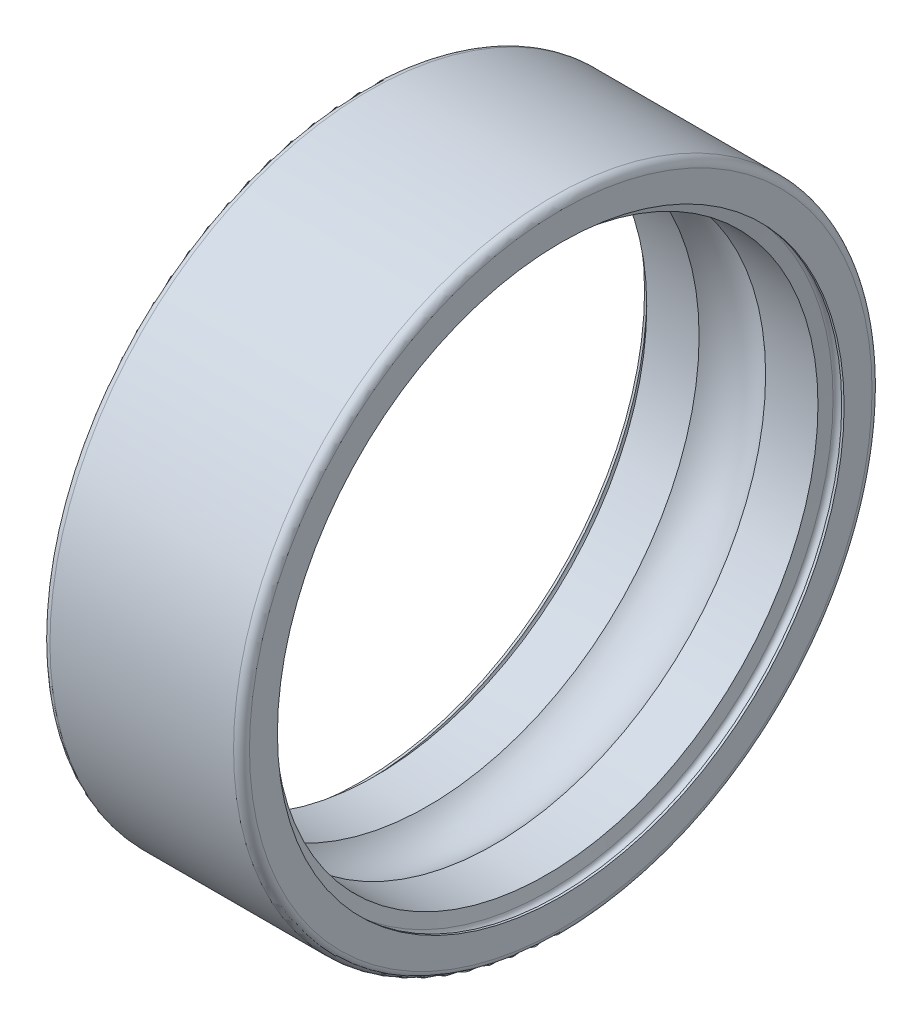
ISO-10303-21;
HEADER;
FILE_DESCRIPTION(('STEP AP214'),'2;1');
FILE_NAME('part.step','',(''),(''),'','','');
FILE_SCHEMA(('AUTOMOTIVE_DESIGN { 1 0 10303 214 1 1 1 1 }'));
ENDSEC;
DATA;
#1=APPLICATION_CONTEXT('core data for automotive mechanical design processes');
#2=APPLICATION_PROTOCOL_DEFINITION('international standard','automotive_design',2000,#1);
#3=PRODUCT_CONTEXT('',#1,'mechanical');
#4=PRODUCT('Part','Part','',(#3));
#5=PRODUCT_RELATED_PRODUCT_CATEGORY('part','',(#4));
#6=PRODUCT_DEFINITION_FORMATION('','',#4);
#7=PRODUCT_DEFINITION_CONTEXT('part definition',#1,'design');
#8=PRODUCT_DEFINITION('design','',#6,#7);
#9=PRODUCT_DEFINITION_SHAPE('','',#8);
#10=(LENGTH_UNIT() NAMED_UNIT(*) SI_UNIT(.MILLI.,.METRE.));
#11=(NAMED_UNIT(*) PLANE_ANGLE_UNIT() SI_UNIT($,.RADIAN.));
#12=(NAMED_UNIT(*) SI_UNIT($,.STERADIAN.) SOLID_ANGLE_UNIT());
#13=UNCERTAINTY_MEASURE_WITH_UNIT(LENGTH_MEASURE(1.E-05),#10,'distance_accuracy_value','');
#14=(GEOMETRIC_REPRESENTATION_CONTEXT(3) GLOBAL_UNCERTAINTY_ASSIGNED_CONTEXT((#13)) GLOBAL_UNIT_ASSIGNED_CONTEXT((#10,
#11,#12)) REPRESENTATION_CONTEXT('',''));
#15=CARTESIAN_POINT('',(0.,0.,0.));
#16=DIRECTION('',(0.,0.,1.));
#17=DIRECTION('',(1.,0.,0.));
#18=AXIS2_PLACEMENT_3D('',#15,#16,#17);
#19=CARTESIAN_POINT('',(4.64525071236117,0.,0.));
#20=DIRECTION('',(1.,0.,0.));
#21=DIRECTION('',(0.,0.,-1.));
#22=AXIS2_PLACEMENT_3D('',#19,#20,#21);
#23=CONICAL_SURFACE('',#22,6.8,1.39626340159546);
#24=CARTESIAN_POINT('',(4.70182306963854,0.,0.));
#25=DIRECTION('',(-1.,0.,0.));
#26=DIRECTION('',(0.,0.,1.));
#27=AXIS2_PLACEMENT_3D('',#24,#25,#26);
#28=CIRCLE('',#27,7.12083778132003);
#29=CARTESIAN_POINT('',(4.70182306963854,0.,7.12083778132003));
#30=VERTEX_POINT('',#29);
#31=EDGE_CURVE('E10',#30,#30,#28,.T.);
#32=ORIENTED_EDGE('',*,*,#31,.F.);
#33=EDGE_LOOP('',(#32));
#34=FACE_BOUND('',#33,.T.);
#35=CARTESIAN_POINT('',(4.64525071236117,0.,0.));
#36=DIRECTION('',(-1.,0.,0.));
#37=DIRECTION('',(0.,0.,1.));
#38=AXIS2_PLACEMENT_3D('',#35,#36,#37);
#39=CIRCLE('',#38,6.8);
#40=CARTESIAN_POINT('',(4.64525071236117,0.,6.8));
#41=VERTEX_POINT('',#40);
#42=EDGE_CURVE('E80',#41,#41,#39,.T.);
#43=ORIENTED_EDGE('',*,*,#42,.T.);
#44=EDGE_LOOP('',(#43));
#45=FACE_BOUND('',#44,.T.);
#46=ADVANCED_FACE('F14',(#34,#45),#23,.F.);
#47=CARTESIAN_POINT('',(4.82,0.,0.));
#48=DIRECTION('',(-1.,0.,0.));
#49=DIRECTION('',(0.,0.,1.));
#50=AXIS2_PLACEMENT_3D('',#47,#48,#49);
#51=TOROIDAL_SURFACE('',#50,7.1,0.12);
#52=ORIENTED_EDGE('',*,*,#31,.T.);
#53=EDGE_LOOP('',(#52));
#54=FACE_BOUND('',#53,.T.);
#55=CARTESIAN_POINT('',(4.94,0.,0.));
#56=DIRECTION('',(-1.,0.,0.));
#57=DIRECTION('',(0.,0.,1.));
#58=AXIS2_PLACEMENT_3D('',#55,#56,#57);
#59=CIRCLE('',#58,7.1);
#60=CARTESIAN_POINT('',(4.94,0.,7.1));
#61=VERTEX_POINT('',#60);
#62=EDGE_CURVE('E21',#61,#61,#59,.T.);
#63=ORIENTED_EDGE('',*,*,#62,.F.);
#64=EDGE_LOOP('',(#63));
#65=FACE_BOUND('',#64,.T.);
#66=ADVANCED_FACE('F105',(#54,#65),#51,.F.);
#67=CARTESIAN_POINT('',(0.,0.,0.));
#68=DIRECTION('',(-1.,0.,0.));
#69=DIRECTION('',(0.,0.,1.));
#70=AXIS2_PLACEMENT_3D('',#67,#68,#69);
#71=CYLINDRICAL_SURFACE('',#70,7.1);
#72=ORIENTED_EDGE('',*,*,#62,.T.);
#73=EDGE_LOOP('',(#72));
#74=FACE_BOUND('',#73,.T.);
#75=CARTESIAN_POINT('',(5.,0.,0.));
#76=DIRECTION('',(-1.,0.,0.));
#77=DIRECTION('',(0.,0.,1.));
#78=AXIS2_PLACEMENT_3D('',#75,#76,#77);
#79=CIRCLE('',#78,7.1);
#80=CARTESIAN_POINT('',(5.,0.,7.1));
#81=VERTEX_POINT('',#80);
#82=EDGE_CURVE('E30',#81,#81,#79,.T.);
#83=ORIENTED_EDGE('',*,*,#82,.F.);
#84=EDGE_LOOP('',(#83));
#85=FACE_BOUND('',#84,.T.);
#86=ADVANCED_FACE('F110',(#74,#85),#71,.F.);
#87=CARTESIAN_POINT('',(5.,7.1,0.));
#88=DIRECTION('',(-1.,0.,0.));
#89=DIRECTION('',(0.,0.,1.));
#90=AXIS2_PLACEMENT_3D('',#87,#88,#89);
#91=PLANE('',#90);
#92=CARTESIAN_POINT('',(5.,0.,0.));
#93=DIRECTION('',(-1.,0.,0.));
#94=DIRECTION('',(0.,0.,1.));
#95=AXIS2_PLACEMENT_3D('',#92,#93,#94);
#96=CIRCLE('',#95,7.8);
#97=CARTESIAN_POINT('',(5.,0.,7.8));
#98=VERTEX_POINT('',#97);
#99=EDGE_CURVE('E38',#98,#98,#96,.T.);
#100=ORIENTED_EDGE('',*,*,#99,.F.);
#101=EDGE_LOOP('',(#100));
#102=FACE_BOUND('',#101,.T.);
#103=ORIENTED_EDGE('',*,*,#82,.T.);
#104=EDGE_LOOP('',(#103));
#105=FACE_BOUND('',#104,.T.);
#106=ADVANCED_FACE('F114',(#102,#105),#91,.F.);
#107=CARTESIAN_POINT('',(4.8,0.,0.));
#108=DIRECTION('',(-1.,0.,0.));
#109=DIRECTION('',(0.,0.,1.));
#110=AXIS2_PLACEMENT_3D('',#107,#108,#109);
#111=TOROIDAL_SURFACE('',#110,7.8,0.2);
#112=CARTESIAN_POINT('',(4.8,0.,0.));
#113=DIRECTION('',(-1.,0.,0.));
#114=DIRECTION('',(0.,0.,1.));
#115=AXIS2_PLACEMENT_3D('',#112,#113,#114);
#116=CIRCLE('',#115,8.);
#117=CARTESIAN_POINT('',(4.8,0.,8.));
#118=VERTEX_POINT('',#117);
#119=EDGE_CURVE('E44',#118,#118,#116,.T.);
#120=ORIENTED_EDGE('',*,*,#119,.F.);
#121=EDGE_LOOP('',(#120));
#122=FACE_BOUND('',#121,.T.);
#123=ORIENTED_EDGE('',*,*,#99,.T.);
#124=EDGE_LOOP('',(#123));
#125=FACE_BOUND('',#124,.T.);
#126=ADVANCED_FACE('F120',(#122,#125),#111,.T.);
#127=CARTESIAN_POINT('',(0.,0.,0.));
#128=DIRECTION('',(-1.,0.,0.));
#129=DIRECTION('',(0.,0.,1.));
#130=AXIS2_PLACEMENT_3D('',#127,#128,#129);
#131=CYLINDRICAL_SURFACE('',#130,8.);
#132=ORIENTED_EDGE('',*,*,#119,.T.);
#133=EDGE_LOOP('',(#132));
#134=FACE_BOUND('',#133,.T.);
#135=CARTESIAN_POINT('',(0.2,0.,0.));
#136=DIRECTION('',(-1.,0.,0.));
#137=DIRECTION('',(0.,0.,1.));
#138=AXIS2_PLACEMENT_3D('',#135,#136,#137);
#139=CIRCLE('',#138,8.);
#140=CARTESIAN_POINT('',(0.2,0.,8.));
#141=VERTEX_POINT('',#140);
#142=EDGE_CURVE('E48',#141,#141,#139,.T.);
#143=ORIENTED_EDGE('',*,*,#142,.F.);
#144=EDGE_LOOP('',(#143));
#145=FACE_BOUND('',#144,.T.);
#146=ADVANCED_FACE('F124',(#134,#145),#131,.T.);
#147=CARTESIAN_POINT('',(0.2,0.,0.));
#148=DIRECTION('',(-1.,0.,0.));
#149=DIRECTION('',(0.,0.,1.));
#150=AXIS2_PLACEMENT_3D('',#147,#148,#149);
#151=TOROIDAL_SURFACE('',#150,7.8,0.2);
#152=CARTESIAN_POINT('',(0.,0.,0.));
#153=DIRECTION('',(-1.,0.,0.));
#154=DIRECTION('',(0.,0.,1.));
#155=AXIS2_PLACEMENT_3D('',#152,#153,#154);
#156=CIRCLE('',#155,7.8);
#157=CARTESIAN_POINT('',(0.,0.,7.8));
#158=VERTEX_POINT('',#157);
#159=EDGE_CURVE('E52',#158,#158,#156,.T.);
#160=ORIENTED_EDGE('',*,*,#159,.F.);
#161=EDGE_LOOP('',(#160));
#162=FACE_BOUND('',#161,.T.);
#163=ORIENTED_EDGE('',*,*,#142,.T.);
#164=EDGE_LOOP('',(#163));
#165=FACE_BOUND('',#164,.T.);
#166=ADVANCED_FACE('F128',(#162,#165),#151,.T.);
#167=CARTESIAN_POINT('',(0.,7.1,0.));
#168=DIRECTION('',(-1.,0.,0.));
#169=DIRECTION('',(0.,0.,1.));
#170=AXIS2_PLACEMENT_3D('',#167,#168,#169);
#171=PLANE('',#170);
#172=ORIENTED_EDGE('',*,*,#159,.T.);
#173=EDGE_LOOP('',(#172));
#174=FACE_BOUND('',#173,.T.);
#175=CARTESIAN_POINT('',(0.,0.,0.));
#176=DIRECTION('',(-1.,0.,0.));
#177=DIRECTION('',(0.,0.,1.));
#178=AXIS2_PLACEMENT_3D('',#175,#176,#177);
#179=CIRCLE('',#178,7.1);
#180=CARTESIAN_POINT('',(0.,0.,7.1));
#181=VERTEX_POINT('',#180);
#182=EDGE_CURVE('E56',#181,#181,#179,.T.);
#183=ORIENTED_EDGE('',*,*,#182,.F.);
#184=EDGE_LOOP('',(#183));
#185=FACE_BOUND('',#184,.T.);
#186=ADVANCED_FACE('F132',(#174,#185),#171,.T.);
#187=CARTESIAN_POINT('',(0.,0.,0.));
#188=DIRECTION('',(-1.,0.,0.));
#189=DIRECTION('',(0.,0.,1.));
#190=AXIS2_PLACEMENT_3D('',#187,#188,#189);
#191=CYLINDRICAL_SURFACE('',#190,7.1);
#192=CARTESIAN_POINT('',(0.06,0.,0.));
#193=DIRECTION('',(-1.,0.,0.));
#194=DIRECTION('',(0.,0.,1.));
#195=AXIS2_PLACEMENT_3D('',#192,#193,#194);
#196=CIRCLE('',#195,7.1);
#197=CARTESIAN_POINT('',(0.06,0.,7.1));
#198=VERTEX_POINT('',#197);
#199=EDGE_CURVE('E60',#198,#198,#196,.T.);
#200=ORIENTED_EDGE('',*,*,#199,.F.);
#201=EDGE_LOOP('',(#200));
#202=FACE_BOUND('',#201,.T.);
#203=ORIENTED_EDGE('',*,*,#182,.T.);
#204=EDGE_LOOP('',(#203));
#205=FACE_BOUND('',#204,.T.);
#206=ADVANCED_FACE('F136',(#202,#205),#191,.F.);
#207=CARTESIAN_POINT('',(0.18,0.,0.));
#208=DIRECTION('',(-1.,0.,0.));
#209=DIRECTION('',(0.,0.,1.));
#210=AXIS2_PLACEMENT_3D('',#207,#208,#209);
#211=TOROIDAL_SURFACE('',#210,7.1,0.12);
#212=ORIENTED_EDGE('',*,*,#199,.T.);
#213=EDGE_LOOP('',(#212));
#214=FACE_BOUND('',#213,.T.);
#215=CARTESIAN_POINT('',(0.298176930361465,0.,0.));
#216=DIRECTION('',(-1.,0.,0.));
#217=DIRECTION('',(0.,0.,1.));
#218=AXIS2_PLACEMENT_3D('',#215,#216,#217);
#219=CIRCLE('',#218,7.12083778132003);
#220=CARTESIAN_POINT('',(0.298176930361465,0.,7.12083778132003));
#221=VERTEX_POINT('',#220);
#222=EDGE_CURVE('E64',#221,#221,#219,.T.);
#223=ORIENTED_EDGE('',*,*,#222,.F.);
#224=EDGE_LOOP('',(#223));
#225=FACE_BOUND('',#224,.T.);
#226=ADVANCED_FACE('F140',(#214,#225),#211,.F.);
#227=CARTESIAN_POINT('',(0.354749287638829,0.,0.));
#228=DIRECTION('',(-1.,0.,0.));
#229=DIRECTION('',(0.,0.,1.));
#230=AXIS2_PLACEMENT_3D('',#227,#228,#229);
#231=CONICAL_SURFACE('',#230,6.8,1.39626340159546);
#232=ORIENTED_EDGE('',*,*,#222,.T.);
#233=EDGE_LOOP('',(#232));
#234=FACE_BOUND('',#233,.T.);
#235=CARTESIAN_POINT('',(0.354749287638829,0.,0.));
#236=DIRECTION('',(-1.,0.,0.));
#237=DIRECTION('',(0.,0.,1.));
#238=AXIS2_PLACEMENT_3D('',#235,#236,#237);
#239=CIRCLE('',#238,6.8);
#240=CARTESIAN_POINT('',(0.354749287638829,0.,6.8));
#241=VERTEX_POINT('',#240);
#242=EDGE_CURVE('E68',#241,#241,#239,.T.);
#243=ORIENTED_EDGE('',*,*,#242,.F.);
#244=EDGE_LOOP('',(#243));
#245=FACE_BOUND('',#244,.T.);
#246=ADVANCED_FACE('F101',(#234,#245),#231,.F.);
#247=CARTESIAN_POINT('',(0.,0.,0.));
#248=DIRECTION('',(-1.,0.,0.));
#249=DIRECTION('',(0.,0.,1.));
#250=AXIS2_PLACEMENT_3D('',#247,#248,#249);
#251=CYLINDRICAL_SURFACE('',#250,6.8);
#252=CARTESIAN_POINT('',(1.6664592091565,0.,0.));
#253=DIRECTION('',(-1.,0.,0.));
#254=DIRECTION('',(0.,0.,1.));
#255=AXIS2_PLACEMENT_3D('',#252,#253,#254);
#256=CIRCLE('',#255,6.8);
#257=CARTESIAN_POINT('',(1.6664592091565,0.,6.8));
#258=VERTEX_POINT('',#257);
#259=EDGE_CURVE('E72',#258,#258,#256,.T.);
#260=ORIENTED_EDGE('',*,*,#259,.F.);
#261=EDGE_LOOP('',(#260));
#262=FACE_BOUND('',#261,.T.);
#263=ORIENTED_EDGE('',*,*,#242,.T.);
#264=EDGE_LOOP('',(#263));
#265=FACE_BOUND('',#264,.T.);
#266=ADVANCED_FACE('F94',(#262,#265),#251,.F.);
#267=CARTESIAN_POINT('',(2.5,0.,0.));
#268=DIRECTION('',(-1.,0.,0.));
#269=DIRECTION('',(0.,0.,1.));
#270=AXIS2_PLACEMENT_3D('',#267,#268,#269);
#271=TOROIDAL_SURFACE('',#270,5.95,1.1905);
#272=ORIENTED_EDGE('',*,*,#259,.T.);
#273=EDGE_LOOP('',(#272));
#274=FACE_BOUND('',#273,.T.);
#275=CARTESIAN_POINT('',(3.3335407908435,0.,0.));
#276=DIRECTION('',(-1.,0.,0.));
#277=DIRECTION('',(0.,0.,1.));
#278=AXIS2_PLACEMENT_3D('',#275,#276,#277);
#279=CIRCLE('',#278,6.8);
#280=CARTESIAN_POINT('',(3.3335407908435,0.,6.8));
#281=VERTEX_POINT('',#280);
#282=EDGE_CURVE('E76',#281,#281,#279,.T.);
#283=ORIENTED_EDGE('',*,*,#282,.F.);
#284=EDGE_LOOP('',(#283));
#285=FACE_BOUND('',#284,.T.);
#286=ADVANCED_FACE('F89',(#274,#285),#271,.F.);
#287=CARTESIAN_POINT('',(0.,0.,0.));
#288=DIRECTION('',(-1.,0.,0.));
#289=DIRECTION('',(0.,0.,1.));
#290=AXIS2_PLACEMENT_3D('',#287,#288,#289);
#291=CYLINDRICAL_SURFACE('',#290,6.8);
#292=ORIENTED_EDGE('',*,*,#42,.F.);
#293=EDGE_LOOP('',(#292));
#294=FACE_BOUND('',#293,.T.);
#295=ORIENTED_EDGE('',*,*,#282,.T.);
#296=EDGE_LOOP('',(#295));
#297=FACE_BOUND('',#296,.T.);
#298=ADVANCED_FACE('F86',(#294,#297),#291,.F.);
#299=CLOSED_SHELL('',(#46,#66,#86,#106,#126,#146,#166,#186,#206,#226,#246,#266,#286,#298));
#300=MANIFOLD_SOLID_BREP('B1',#299);
#301=ADVANCED_BREP_SHAPE_REPRESENTATION('',(#18,#300),#14);
#302=SHAPE_DEFINITION_REPRESENTATION(#9,#301);
ENDSEC;
END-ISO-10303-21;
